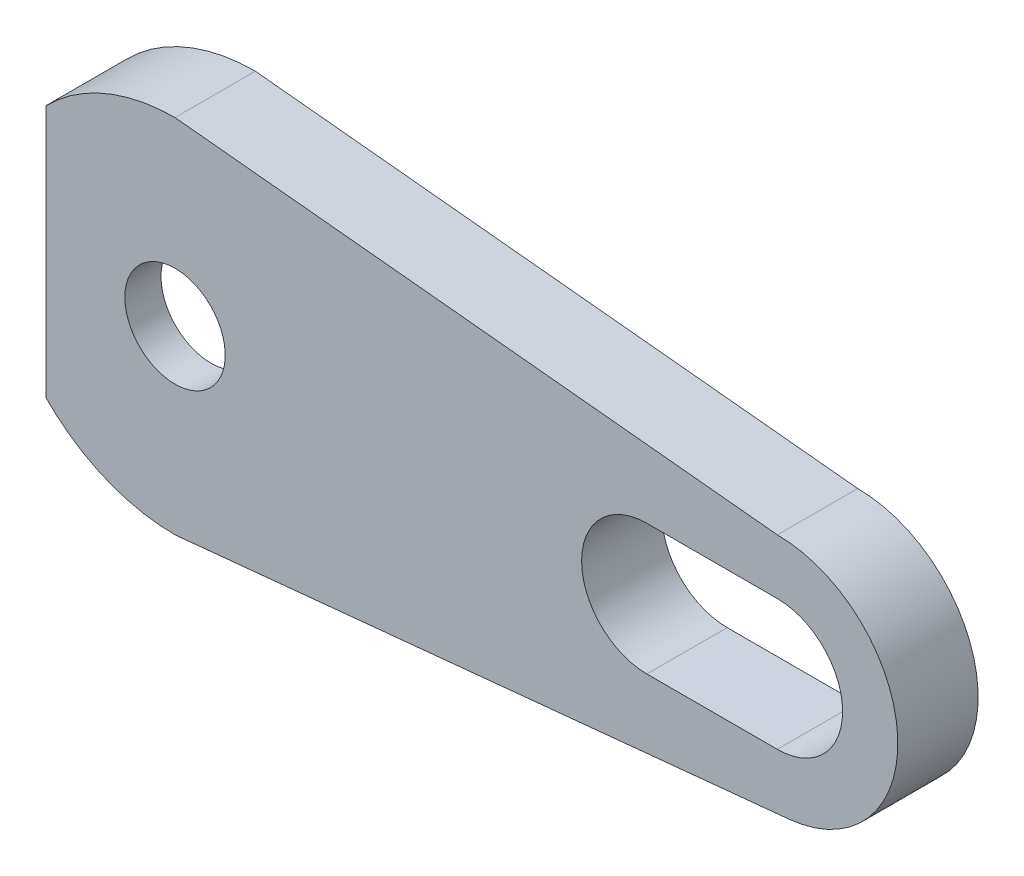
ISO-10303-21;
HEADER;
FILE_DESCRIPTION(('STEP AP214'),'2;1');
FILE_NAME('part.step','',(''),(''),'','','');
FILE_SCHEMA(('AUTOMOTIVE_DESIGN { 1 0 10303 214 1 1 1 1 }'));
ENDSEC;
DATA;
#1=APPLICATION_CONTEXT('core data for automotive mechanical design processes');
#2=APPLICATION_PROTOCOL_DEFINITION('international standard','automotive_design',2000,#1);
#3=PRODUCT_CONTEXT('',#1,'mechanical');
#4=PRODUCT('Part','Part','',(#3));
#5=PRODUCT_RELATED_PRODUCT_CATEGORY('part','',(#4));
#6=PRODUCT_DEFINITION_FORMATION('','',#4);
#7=PRODUCT_DEFINITION_CONTEXT('part definition',#1,'design');
#8=PRODUCT_DEFINITION('design','',#6,#7);
#9=PRODUCT_DEFINITION_SHAPE('','',#8);
#10=(LENGTH_UNIT() NAMED_UNIT(*) SI_UNIT(.MILLI.,.METRE.));
#11=(NAMED_UNIT(*) PLANE_ANGLE_UNIT() SI_UNIT($,.RADIAN.));
#12=(NAMED_UNIT(*) SI_UNIT($,.STERADIAN.) SOLID_ANGLE_UNIT());
#13=UNCERTAINTY_MEASURE_WITH_UNIT(LENGTH_MEASURE(1.E-05),#10,'distance_accuracy_value','');
#14=(GEOMETRIC_REPRESENTATION_CONTEXT(3) GLOBAL_UNCERTAINTY_ASSIGNED_CONTEXT((#13)) GLOBAL_UNIT_ASSIGNED_CONTEXT((#10,
#11,#12)) REPRESENTATION_CONTEXT('',''));
#15=CARTESIAN_POINT('',(0.,0.,0.));
#16=DIRECTION('',(0.,0.,1.));
#17=DIRECTION('',(1.,0.,0.));
#18=AXIS2_PLACEMENT_3D('',#15,#16,#17);
#19=CARTESIAN_POINT('',(0.,0.,4.));
#20=DIRECTION('',(0.,0.,-1.));
#21=DIRECTION('',(-1.,0.,0.));
#22=AXIS2_PLACEMENT_3D('',#19,#20,#21);
#23=PLANE('',#22);
#24=DIRECTION('',(1.,0.,0.));
#25=VECTOR('',#24,1.);
#26=CARTESIAN_POINT('',(23.5,-3.25,4.));
#27=LINE('',#26,#25);
#28=CARTESIAN_POINT('',(23.5,-3.25,4.));
#29=VERTEX_POINT('',#28);
#30=CARTESIAN_POINT('',(30.,-3.25,4.));
#31=VERTEX_POINT('',#30);
#32=EDGE_CURVE('E272',#29,#31,#27,.T.);
#33=ORIENTED_EDGE('',*,*,#32,.F.);
#34=CARTESIAN_POINT('',(23.5,0.,4.));
#35=DIRECTION('',(0.,0.,1.));
#36=DIRECTION('',(1.,0.,0.));
#37=AXIS2_PLACEMENT_3D('',#34,#35,#36);
#38=CIRCLE('',#37,3.25);
#39=CARTESIAN_POINT('',(23.5,3.25,4.));
#40=VERTEX_POINT('',#39);
#41=EDGE_CURVE('E260',#40,#29,#38,.T.);
#42=ORIENTED_EDGE('',*,*,#41,.F.);
#43=DIRECTION('',(-1.,0.,0.));
#44=VECTOR('',#43,1.);
#45=CARTESIAN_POINT('',(23.5,3.25,4.));
#46=LINE('',#45,#44);
#47=CARTESIAN_POINT('',(30.,3.25,4.));
#48=VERTEX_POINT('',#47);
#49=EDGE_CURVE('E256',#48,#40,#46,.T.);
#50=ORIENTED_EDGE('',*,*,#49,.F.);
#51=CARTESIAN_POINT('',(30.,0.,4.));
#52=DIRECTION('',(0.,0.,1.));
#53=DIRECTION('',(-1.,0.,0.));
#54=AXIS2_PLACEMENT_3D('',#51,#52,#53);
#55=CIRCLE('',#54,3.25);
#56=EDGE_CURVE('E270',#31,#48,#55,.T.);
#57=ORIENTED_EDGE('',*,*,#56,.F.);
#58=EDGE_LOOP('',(#33,#42,#50,#57));
#59=FACE_BOUND('',#58,.T.);
#60=DIRECTION('',(0.995133097794459,0.0985399293383375,0.));
#61=VECTOR('',#60,1.);
#62=CARTESIAN_POINT('',(0.,-9.,4.));
#63=LINE('',#62,#61);
#64=CARTESIAN_POINT('',(0.,-9.,4.));
#65=VERTEX_POINT('',#64);
#66=CARTESIAN_POINT('',(30.59123957603,-5.97079858676675,4.));
#67=VERTEX_POINT('',#66);
#68=EDGE_CURVE('E243',#65,#67,#63,.T.);
#69=ORIENTED_EDGE('',*,*,#68,.T.);
#70=CARTESIAN_POINT('',(30.,0.,4.));
#71=DIRECTION('',(0.,0.,1.));
#72=DIRECTION('',(-1.,0.,0.));
#73=AXIS2_PLACEMENT_3D('',#70,#71,#72);
#74=CIRCLE('',#73,6.);
#75=CARTESIAN_POINT('',(30.,6.,4.));
#76=VERTEX_POINT('',#75);
#77=EDGE_CURVE('E241',#67,#76,#74,.T.);
#78=ORIENTED_EDGE('',*,*,#77,.T.);
#79=DIRECTION('',(-0.995037190209989,0.0995037190209989,0.));
#80=VECTOR('',#79,1.);
#81=CARTESIAN_POINT('',(0.,9.,4.));
#82=LINE('',#81,#80);
#83=CARTESIAN_POINT('',(0.,9.,4.));
#84=VERTEX_POINT('',#83);
#85=EDGE_CURVE('E207',#76,#84,#82,.T.);
#86=ORIENTED_EDGE('',*,*,#85,.T.);
#87=CARTESIAN_POINT('',(0.,0.,4.));
#88=DIRECTION('',(0.,0.,1.));
#89=DIRECTION('',(-1.,0.,0.));
#90=AXIS2_PLACEMENT_3D('',#87,#88,#89);
#91=CIRCLE('',#90,9.);
#92=CARTESIAN_POINT('',(-6.42654307097902,6.30075742723457,4.));
#93=VERTEX_POINT('',#92);
#94=EDGE_CURVE('E211',#84,#93,#91,.T.);
#95=ORIENTED_EDGE('',*,*,#94,.T.);
#96=DIRECTION('',(0.,1.,0.));
#97=VECTOR('',#96,1.);
#98=CARTESIAN_POINT('',(-6.42654307097901,-6.30075742723457,4.));
#99=LINE('',#98,#97);
#100=CARTESIAN_POINT('',(-6.42654307097901,-6.30075742723457,4.));
#101=VERTEX_POINT('',#100);
#102=EDGE_CURVE('E160',#101,#93,#99,.T.);
#103=ORIENTED_EDGE('',*,*,#102,.F.);
#104=CARTESIAN_POINT('',(0.,0.,4.));
#105=DIRECTION('',(0.,0.,1.));
#106=DIRECTION('',(1.,0.,0.));
#107=AXIS2_PLACEMENT_3D('',#104,#105,#106);
#108=CIRCLE('',#107,9.);
#109=EDGE_CURVE('E245',#101,#65,#108,.T.);
#110=ORIENTED_EDGE('',*,*,#109,.T.);
#111=EDGE_LOOP('',(#69,#78,#86,#95,#103,#110));
#112=FACE_BOUND('',#111,.T.);
#113=CARTESIAN_POINT('',(0.,0.,4.));
#114=DIRECTION('',(0.,0.,-1.));
#115=DIRECTION('',(-1.,0.,0.));
#116=AXIS2_PLACEMENT_3D('',#113,#114,#115);
#117=CIRCLE('',#116,2.5);
#118=CARTESIAN_POINT('',(-2.5,0.,4.));
#119=VERTEX_POINT('',#118);
#120=EDGE_CURVE('E291',#119,#119,#117,.T.);
#121=ORIENTED_EDGE('',*,*,#120,.T.);
#122=EDGE_LOOP('',(#121));
#123=FACE_BOUND('',#122,.T.);
#124=ADVANCED_FACE('F35',(#59,#112,#123),#23,.F.);
#125=CARTESIAN_POINT('',(0.,0.,0.));
#126=DIRECTION('',(0.,0.,-1.));
#127=DIRECTION('',(-1.,0.,0.));
#128=AXIS2_PLACEMENT_3D('',#125,#126,#127);
#129=PLANE('',#128);
#130=CARTESIAN_POINT('',(0.,0.,0.));
#131=DIRECTION('',(0.,0.,1.));
#132=DIRECTION('',(-1.,0.,0.));
#133=AXIS2_PLACEMENT_3D('',#130,#131,#132);
#134=CIRCLE('',#133,9.);
#135=CARTESIAN_POINT('',(0.,9.,0.));
#136=VERTEX_POINT('',#135);
#137=CARTESIAN_POINT('',(-6.42654307097901,6.30075742723457,0.));
#138=VERTEX_POINT('',#137);
#139=EDGE_CURVE('E179',#136,#138,#134,.T.);
#140=ORIENTED_EDGE('',*,*,#139,.F.);
#141=DIRECTION('',(-0.995037190209989,0.0995037190209989,0.));
#142=VECTOR('',#141,1.);
#143=CARTESIAN_POINT('',(0.,9.,0.));
#144=LINE('',#143,#142);
#145=CARTESIAN_POINT('',(30.,6.,0.));
#146=VERTEX_POINT('',#145);
#147=EDGE_CURVE('E208',#146,#136,#144,.T.);
#148=ORIENTED_EDGE('',*,*,#147,.F.);
#149=CARTESIAN_POINT('',(30.,0.,0.));
#150=DIRECTION('',(0.,0.,1.));
#151=DIRECTION('',(-1.,0.,0.));
#152=AXIS2_PLACEMENT_3D('',#149,#150,#151);
#153=CIRCLE('',#152,6.);
#154=CARTESIAN_POINT('',(30.59123957603,-5.97079858676675,0.));
#155=VERTEX_POINT('',#154);
#156=EDGE_CURVE('E212',#155,#146,#153,.T.);
#157=ORIENTED_EDGE('',*,*,#156,.F.);
#158=DIRECTION('',(0.995133097794459,0.0985399293383375,0.));
#159=VECTOR('',#158,1.);
#160=CARTESIAN_POINT('',(0.,-9.,0.));
#161=LINE('',#160,#159);
#162=CARTESIAN_POINT('',(0.,-9.,0.));
#163=VERTEX_POINT('',#162);
#164=EDGE_CURVE('E214',#163,#155,#161,.T.);
#165=ORIENTED_EDGE('',*,*,#164,.F.);
#166=CARTESIAN_POINT('',(0.,0.,0.));
#167=DIRECTION('',(0.,0.,1.));
#168=DIRECTION('',(1.,0.,0.));
#169=AXIS2_PLACEMENT_3D('',#166,#167,#168);
#170=CIRCLE('',#169,9.);
#171=CARTESIAN_POINT('',(-6.42654307097901,-6.30075742723457,0.));
#172=VERTEX_POINT('',#171);
#173=EDGE_CURVE('E216',#172,#163,#170,.T.);
#174=ORIENTED_EDGE('',*,*,#173,.F.);
#175=DIRECTION('',(-0.707106781186548,-0.707106781186548,0.));
#176=VECTOR('',#175,1.);
#177=CARTESIAN_POINT('',(-4.37578564374445,-4.25,0.));
#178=LINE('',#177,#176);
#179=CARTESIAN_POINT('',(-4.37578564374444,-4.25,0.));
#180=VERTEX_POINT('',#179);
#181=EDGE_CURVE('E219',#180,#172,#178,.T.);
#182=ORIENTED_EDGE('',*,*,#181,.F.);
#183=CARTESIAN_POINT('',(0.,0.,0.));
#184=DIRECTION('',(0.,0.,-1.));
#185=DIRECTION('',(-1.,0.,0.));
#186=AXIS2_PLACEMENT_3D('',#183,#184,#185);
#187=CIRCLE('',#186,6.1);
#188=CARTESIAN_POINT('',(4.37578564374445,-4.25,0.));
#189=VERTEX_POINT('',#188);
#190=EDGE_CURVE('E222',#189,#180,#187,.T.);
#191=ORIENTED_EDGE('',*,*,#190,.F.);
#192=DIRECTION('',(-0.993627549913592,-0.112713317991759,0.));
#193=VECTOR('',#192,1.);
#194=CARTESIAN_POINT('',(17.3155972903769,-2.78215713975806,0.));
#195=LINE('',#194,#193);
#196=CARTESIAN_POINT('',(17.3155972903769,-2.78215713975806,0.));
#197=VERTEX_POINT('',#196);
#198=EDGE_CURVE('E225',#197,#189,#195,.T.);
#199=ORIENTED_EDGE('',*,*,#198,.F.);
#200=CARTESIAN_POINT('',(17.,0.,0.));
#201=DIRECTION('',(0.,0.,-1.));
#202=DIRECTION('',(1.,0.,0.));
#203=AXIS2_PLACEMENT_3D('',#200,#201,#202);
#204=CIRCLE('',#203,2.8);
#205=CARTESIAN_POINT('',(17.3155972903769,2.78215713975806,0.));
#206=VERTEX_POINT('',#205);
#207=EDGE_CURVE('E228',#206,#197,#204,.T.);
#208=ORIENTED_EDGE('',*,*,#207,.F.);
#209=DIRECTION('',(0.993627549913592,-0.112713317991759,0.));
#210=VECTOR('',#209,1.);
#211=CARTESIAN_POINT('',(4.37578564374445,4.25,0.));
#212=LINE('',#211,#210);
#213=CARTESIAN_POINT('',(4.37578564374445,4.25,0.));
#214=VERTEX_POINT('',#213);
#215=EDGE_CURVE('E231',#214,#206,#212,.T.);
#216=ORIENTED_EDGE('',*,*,#215,.F.);
#217=CARTESIAN_POINT('',(0.,0.,0.));
#218=DIRECTION('',(0.,0.,-1.));
#219=DIRECTION('',(1.,0.,0.));
#220=AXIS2_PLACEMENT_3D('',#217,#218,#219);
#221=CIRCLE('',#220,6.1);
#222=CARTESIAN_POINT('',(-4.37578564374445,4.25,0.));
#223=VERTEX_POINT('',#222);
#224=EDGE_CURVE('E234',#223,#214,#221,.T.);
#225=ORIENTED_EDGE('',*,*,#224,.F.);
#226=DIRECTION('',(0.707106781186548,-0.707106781186548,0.));
#227=VECTOR('',#226,1.);
#228=CARTESIAN_POINT('',(-4.37578564374445,4.25,0.));
#229=LINE('',#228,#227);
#230=EDGE_CURVE('E236',#138,#223,#229,.T.);
#231=ORIENTED_EDGE('',*,*,#230,.F.);
#232=EDGE_LOOP('',(#140,#148,#157,#165,#174,#182,#191,#199,#208,#216,#225,#231));
#233=FACE_BOUND('',#232,.T.);
#234=DIRECTION('',(-1.,0.,0.));
#235=VECTOR('',#234,1.);
#236=CARTESIAN_POINT('',(23.5,3.25,0.));
#237=LINE('',#236,#235);
#238=CARTESIAN_POINT('',(30.,3.25,0.));
#239=VERTEX_POINT('',#238);
#240=CARTESIAN_POINT('',(23.5,3.25,0.));
#241=VERTEX_POINT('',#240);
#242=EDGE_CURVE('E257',#239,#241,#237,.T.);
#243=ORIENTED_EDGE('',*,*,#242,.T.);
#244=CARTESIAN_POINT('',(23.5,0.,0.));
#245=DIRECTION('',(0.,0.,1.));
#246=DIRECTION('',(1.,0.,0.));
#247=AXIS2_PLACEMENT_3D('',#244,#245,#246);
#248=CIRCLE('',#247,3.25);
#249=CARTESIAN_POINT('',(23.5,-3.25,0.));
#250=VERTEX_POINT('',#249);
#251=EDGE_CURVE('E174',#241,#250,#248,.T.);
#252=ORIENTED_EDGE('',*,*,#251,.T.);
#253=DIRECTION('',(1.,0.,0.));
#254=VECTOR('',#253,1.);
#255=CARTESIAN_POINT('',(23.5,-3.25,0.));
#256=LINE('',#255,#254);
#257=CARTESIAN_POINT('',(30.,-3.25,0.));
#258=VERTEX_POINT('',#257);
#259=EDGE_CURVE('E264',#250,#258,#256,.T.);
#260=ORIENTED_EDGE('',*,*,#259,.T.);
#261=CARTESIAN_POINT('',(30.,0.,0.));
#262=DIRECTION('',(0.,0.,1.));
#263=DIRECTION('',(-1.,0.,0.));
#264=AXIS2_PLACEMENT_3D('',#261,#262,#263);
#265=CIRCLE('',#264,3.25);
#266=EDGE_CURVE('E261',#258,#239,#265,.T.);
#267=ORIENTED_EDGE('',*,*,#266,.T.);
#268=EDGE_LOOP('',(#243,#252,#260,#267));
#269=FACE_BOUND('',#268,.T.);
#270=ADVANCED_FACE('F311',(#233,#269),#129,.T.);
#271=CARTESIAN_POINT('',(0.,0.,4.));
#272=DIRECTION('',(0.,0.,-1.));
#273=DIRECTION('',(-1.,0.,0.));
#274=AXIS2_PLACEMENT_3D('',#271,#272,#273);
#275=CYLINDRICAL_SURFACE('',#274,9.);
#276=DIRECTION('',(0.,0.,-1.));
#277=VECTOR('',#276,1.);
#278=CARTESIAN_POINT('',(-6.42654307097901,6.30075742723457,4.));
#279=LINE('',#278,#277);
#280=CARTESIAN_POINT('',(-6.42654307097902,6.30075742723457,2.2));
#281=VERTEX_POINT('',#280);
#282=EDGE_CURVE('E43',#281,#138,#279,.T.);
#283=ORIENTED_EDGE('',*,*,#282,.F.);
#284=EDGE_CURVE('E11',#93,#281,#279,.T.);
#285=ORIENTED_EDGE('',*,*,#284,.F.);
#286=ORIENTED_EDGE('',*,*,#94,.F.);
#287=DIRECTION('',(0.,0.,-1.));
#288=VECTOR('',#287,1.);
#289=CARTESIAN_POINT('',(0.,9.,4.));
#290=LINE('',#289,#288);
#291=EDGE_CURVE('E205',#84,#136,#290,.T.);
#292=ORIENTED_EDGE('',*,*,#291,.T.);
#293=ORIENTED_EDGE('',*,*,#139,.T.);
#294=EDGE_LOOP('',(#283,#285,#286,#292,#293));
#295=FACE_BOUND('',#294,.T.);
#296=ADVANCED_FACE('F37',(#295),#275,.T.);
#297=CARTESIAN_POINT('',(-4.37578564374445,4.25,4.));
#298=DIRECTION('',(0.707106781186547,0.707106781186547,0.));
#299=DIRECTION('',(-0.707106781186548,0.707106781186548,0.));
#300=AXIS2_PLACEMENT_3D('',#297,#298,#299);
#301=PLANE('',#300);
#302=DIRECTION('',(0.,0.,-1.));
#303=VECTOR('',#302,1.);
#304=CARTESIAN_POINT('',(-4.37578564374445,4.25,4.));
#305=LINE('',#304,#303);
#306=CARTESIAN_POINT('',(-4.37578564374445,4.25,2.2));
#307=VERTEX_POINT('',#306);
#308=EDGE_CURVE('E173',#307,#223,#305,.T.);
#309=ORIENTED_EDGE('',*,*,#308,.F.);
#310=DIRECTION('',(-0.707106781186548,0.707106781186548,0.));
#311=VECTOR('',#310,1.);
#312=CARTESIAN_POINT('',(-4.37578564374445,4.25,2.2));
#313=LINE('',#312,#311);
#314=EDGE_CURVE('E155',#307,#281,#313,.T.);
#315=ORIENTED_EDGE('',*,*,#314,.T.);
#316=ORIENTED_EDGE('',*,*,#282,.T.);
#317=ORIENTED_EDGE('',*,*,#230,.T.);
#318=EDGE_LOOP('',(#309,#315,#316,#317));
#319=FACE_BOUND('',#318,.T.);
#320=ADVANCED_FACE('F170',(#319),#301,.F.);
#321=CARTESIAN_POINT('',(0.,0.,4.));
#322=DIRECTION('',(0.,0.,-1.));
#323=DIRECTION('',(-1.,0.,0.));
#324=AXIS2_PLACEMENT_3D('',#321,#322,#323);
#325=CYLINDRICAL_SURFACE('',#324,6.1);
#326=DIRECTION('',(0.,0.,-1.));
#327=VECTOR('',#326,1.);
#328=CARTESIAN_POINT('',(4.37578564374445,4.25,4.));
#329=LINE('',#328,#327);
#330=CARTESIAN_POINT('',(4.37578564374445,4.25,2.2));
#331=VERTEX_POINT('',#330);
#332=EDGE_CURVE('E180',#331,#214,#329,.T.);
#333=ORIENTED_EDGE('',*,*,#332,.F.);
#334=CARTESIAN_POINT('',(0.,0.,2.2));
#335=DIRECTION('',(0.,0.,-1.));
#336=DIRECTION('',(-1.,0.,0.));
#337=AXIS2_PLACEMENT_3D('',#334,#335,#336);
#338=CIRCLE('',#337,6.1);
#339=EDGE_CURVE('E175',#331,#307,#338,.F.);
#340=ORIENTED_EDGE('',*,*,#339,.T.);
#341=ORIENTED_EDGE('',*,*,#308,.T.);
#342=ORIENTED_EDGE('',*,*,#224,.T.);
#343=EDGE_LOOP('',(#333,#340,#341,#342));
#344=FACE_BOUND('',#343,.T.);
#345=ADVANCED_FACE('F360',(#344),#325,.F.);
#346=CARTESIAN_POINT('',(4.37578564374445,4.25,4.));
#347=DIRECTION('',(0.112713317991759,0.993627549913592,0.));
#348=DIRECTION('',(-0.993627549913592,0.112713317991759,0.));
#349=AXIS2_PLACEMENT_3D('',#346,#347,#348);
#350=PLANE('',#349);
#351=DIRECTION('',(0.,0.,-1.));
#352=VECTOR('',#351,1.);
#353=CARTESIAN_POINT('',(17.3155972903769,2.78215713975806,4.));
#354=LINE('',#353,#352);
#355=CARTESIAN_POINT('',(17.3155972903769,2.78215713975806,2.2));
#356=VERTEX_POINT('',#355);
#357=EDGE_CURVE('E183',#356,#206,#354,.T.);
#358=ORIENTED_EDGE('',*,*,#357,.F.);
#359=DIRECTION('',(-0.993627549913592,0.112713317991759,0.));
#360=VECTOR('',#359,1.);
#361=CARTESIAN_POINT('',(4.37578564374445,4.25,2.2));
#362=LINE('',#361,#360);
#363=EDGE_CURVE('E276',#356,#331,#362,.T.);
#364=ORIENTED_EDGE('',*,*,#363,.T.);
#365=ORIENTED_EDGE('',*,*,#332,.T.);
#366=ORIENTED_EDGE('',*,*,#215,.T.);
#367=EDGE_LOOP('',(#358,#364,#365,#366));
#368=FACE_BOUND('',#367,.T.);
#369=ADVANCED_FACE('F356',(#368),#350,.F.);
#370=CARTESIAN_POINT('',(17.,0.,4.));
#371=DIRECTION('',(0.,0.,-1.));
#372=DIRECTION('',(-1.,0.,0.));
#373=AXIS2_PLACEMENT_3D('',#370,#371,#372);
#374=CYLINDRICAL_SURFACE('',#373,2.8);
#375=DIRECTION('',(0.,0.,-1.));
#376=VECTOR('',#375,1.);
#377=CARTESIAN_POINT('',(17.3155972903769,-2.78215713975806,4.));
#378=LINE('',#377,#376);
#379=CARTESIAN_POINT('',(17.3155972903769,-2.78215713975806,2.2));
#380=VERTEX_POINT('',#379);
#381=EDGE_CURVE('E187',#380,#197,#378,.T.);
#382=ORIENTED_EDGE('',*,*,#381,.F.);
#383=CARTESIAN_POINT('',(17.,0.,2.2));
#384=DIRECTION('',(0.,0.,-1.));
#385=DIRECTION('',(-1.,0.,0.));
#386=AXIS2_PLACEMENT_3D('',#383,#384,#385);
#387=CIRCLE('',#386,2.8);
#388=EDGE_CURVE('E279',#380,#356,#387,.F.);
#389=ORIENTED_EDGE('',*,*,#388,.T.);
#390=ORIENTED_EDGE('',*,*,#357,.T.);
#391=ORIENTED_EDGE('',*,*,#207,.T.);
#392=EDGE_LOOP('',(#382,#389,#390,#391));
#393=FACE_BOUND('',#392,.T.);
#394=ADVANCED_FACE('F352',(#393),#374,.F.);
#395=CARTESIAN_POINT('',(17.3155972903769,-2.78215713975806,4.));
#396=DIRECTION('',(0.112713317991759,-0.993627549913592,0.));
#397=DIRECTION('',(0.993627549913592,0.112713317991759,0.));
#398=AXIS2_PLACEMENT_3D('',#395,#396,#397);
#399=PLANE('',#398);
#400=DIRECTION('',(0.,0.,-1.));
#401=VECTOR('',#400,1.);
#402=CARTESIAN_POINT('',(4.37578564374445,-4.25,4.));
#403=LINE('',#402,#401);
#404=CARTESIAN_POINT('',(4.37578564374445,-4.25,2.2));
#405=VERTEX_POINT('',#404);
#406=EDGE_CURVE('E189',#405,#189,#403,.T.);
#407=ORIENTED_EDGE('',*,*,#406,.F.);
#408=DIRECTION('',(0.993627549913592,0.112713317991759,0.));
#409=VECTOR('',#408,1.);
#410=CARTESIAN_POINT('',(17.3155972903769,-2.78215713975806,2.2));
#411=LINE('',#410,#409);
#412=EDGE_CURVE('E282',#405,#380,#411,.T.);
#413=ORIENTED_EDGE('',*,*,#412,.T.);
#414=ORIENTED_EDGE('',*,*,#381,.T.);
#415=ORIENTED_EDGE('',*,*,#198,.T.);
#416=EDGE_LOOP('',(#407,#413,#414,#415));
#417=FACE_BOUND('',#416,.T.);
#418=ADVANCED_FACE('F348',(#417),#399,.F.);
#419=CARTESIAN_POINT('',(0.,0.,4.));
#420=DIRECTION('',(0.,0.,-1.));
#421=DIRECTION('',(-1.,0.,0.));
#422=AXIS2_PLACEMENT_3D('',#419,#420,#421);
#423=CYLINDRICAL_SURFACE('',#422,6.1);
#424=DIRECTION('',(0.,0.,-1.));
#425=VECTOR('',#424,1.);
#426=CARTESIAN_POINT('',(-4.37578564374444,-4.25,4.));
#427=LINE('',#426,#425);
#428=CARTESIAN_POINT('',(-4.37578564374445,-4.25,2.2));
#429=VERTEX_POINT('',#428);
#430=EDGE_CURVE('E191',#429,#180,#427,.T.);
#431=ORIENTED_EDGE('',*,*,#430,.F.);
#432=CARTESIAN_POINT('',(0.,0.,2.2));
#433=DIRECTION('',(0.,0.,-1.));
#434=DIRECTION('',(-1.,0.,0.));
#435=AXIS2_PLACEMENT_3D('',#432,#433,#434);
#436=CIRCLE('',#435,6.1);
#437=EDGE_CURVE('E285',#429,#405,#436,.F.);
#438=ORIENTED_EDGE('',*,*,#437,.T.);
#439=ORIENTED_EDGE('',*,*,#406,.T.);
#440=ORIENTED_EDGE('',*,*,#190,.T.);
#441=EDGE_LOOP('',(#431,#438,#439,#440));
#442=FACE_BOUND('',#441,.T.);
#443=ADVANCED_FACE('F344',(#442),#423,.F.);
#444=CARTESIAN_POINT('',(-4.37578564374445,-4.25,4.));
#445=DIRECTION('',(0.707106781186547,-0.707106781186547,0.));
#446=DIRECTION('',(0.707106781186548,0.707106781186548,0.));
#447=AXIS2_PLACEMENT_3D('',#444,#445,#446);
#448=PLANE('',#447);
#449=DIRECTION('',(0.,0.,-1.));
#450=VECTOR('',#449,1.);
#451=CARTESIAN_POINT('',(-6.42654307097901,-6.30075742723457,4.));
#452=LINE('',#451,#450);
#453=CARTESIAN_POINT('',(-6.42654307097901,-6.30075742723457,2.2));
#454=VERTEX_POINT('',#453);
#455=EDGE_CURVE('E196',#454,#172,#452,.T.);
#456=ORIENTED_EDGE('',*,*,#455,.F.);
#457=DIRECTION('',(0.707106781186548,0.707106781186548,0.));
#458=VECTOR('',#457,1.);
#459=CARTESIAN_POINT('',(-4.37578564374445,-4.25,2.2));
#460=LINE('',#459,#458);
#461=EDGE_CURVE('E158',#454,#429,#460,.T.);
#462=ORIENTED_EDGE('',*,*,#461,.T.);
#463=ORIENTED_EDGE('',*,*,#430,.T.);
#464=ORIENTED_EDGE('',*,*,#181,.T.);
#465=EDGE_LOOP('',(#456,#462,#463,#464));
#466=FACE_BOUND('',#465,.T.);
#467=ADVANCED_FACE('F340',(#466),#448,.F.);
#468=CARTESIAN_POINT('',(0.,0.,4.));
#469=DIRECTION('',(0.,0.,-1.));
#470=DIRECTION('',(-1.,0.,0.));
#471=AXIS2_PLACEMENT_3D('',#468,#469,#470);
#472=CYLINDRICAL_SURFACE('',#471,9.);
#473=ORIENTED_EDGE('',*,*,#173,.T.);
#474=DIRECTION('',(0.,0.,-1.));
#475=VECTOR('',#474,1.);
#476=CARTESIAN_POINT('',(0.,-9.,4.));
#477=LINE('',#476,#475);
#478=EDGE_CURVE('E197',#65,#163,#477,.T.);
#479=ORIENTED_EDGE('',*,*,#478,.F.);
#480=ORIENTED_EDGE('',*,*,#109,.F.);
#481=EDGE_CURVE('E193',#101,#454,#452,.T.);
#482=ORIENTED_EDGE('',*,*,#481,.T.);
#483=ORIENTED_EDGE('',*,*,#455,.T.);
#484=EDGE_LOOP('',(#473,#479,#480,#482,#483));
#485=FACE_BOUND('',#484,.T.);
#486=ADVANCED_FACE('F336',(#485),#472,.T.);
#487=CARTESIAN_POINT('',(0.,-9.,4.));
#488=DIRECTION('',(-0.0985399293383375,0.995133097794459,0.));
#489=DIRECTION('',(-0.995133097794459,-0.0985399293383375,0.));
#490=AXIS2_PLACEMENT_3D('',#487,#488,#489);
#491=PLANE('',#490);
#492=ORIENTED_EDGE('',*,*,#478,.T.);
#493=ORIENTED_EDGE('',*,*,#164,.T.);
#494=DIRECTION('',(0.,0.,-1.));
#495=VECTOR('',#494,1.);
#496=CARTESIAN_POINT('',(30.59123957603,-5.97079858676675,4.));
#497=LINE('',#496,#495);
#498=EDGE_CURVE('E199',#67,#155,#497,.T.);
#499=ORIENTED_EDGE('',*,*,#498,.F.);
#500=ORIENTED_EDGE('',*,*,#68,.F.);
#501=EDGE_LOOP('',(#492,#493,#499,#500));
#502=FACE_BOUND('',#501,.T.);
#503=ADVANCED_FACE('F332',(#502),#491,.F.);
#504=CARTESIAN_POINT('',(30.,0.,4.));
#505=DIRECTION('',(0.,0.,-1.));
#506=DIRECTION('',(-1.,0.,0.));
#507=AXIS2_PLACEMENT_3D('',#504,#505,#506);
#508=CYLINDRICAL_SURFACE('',#507,6.);
#509=ORIENTED_EDGE('',*,*,#156,.T.);
#510=DIRECTION('',(0.,0.,-1.));
#511=VECTOR('',#510,1.);
#512=CARTESIAN_POINT('',(30.,6.,4.));
#513=LINE('',#512,#511);
#514=EDGE_CURVE('E202',#76,#146,#513,.T.);
#515=ORIENTED_EDGE('',*,*,#514,.F.);
#516=ORIENTED_EDGE('',*,*,#77,.F.);
#517=ORIENTED_EDGE('',*,*,#498,.T.);
#518=EDGE_LOOP('',(#509,#515,#516,#517));
#519=FACE_BOUND('',#518,.T.);
#520=ADVANCED_FACE('F328',(#519),#508,.T.);
#521=CARTESIAN_POINT('',(0.,9.,4.));
#522=DIRECTION('',(-0.0995037190209989,-0.995037190209989,0.));
#523=DIRECTION('',(0.995037190209989,-0.0995037190209989,0.));
#524=AXIS2_PLACEMENT_3D('',#521,#522,#523);
#525=PLANE('',#524);
#526=ORIENTED_EDGE('',*,*,#147,.T.);
#527=ORIENTED_EDGE('',*,*,#291,.F.);
#528=ORIENTED_EDGE('',*,*,#85,.F.);
#529=ORIENTED_EDGE('',*,*,#514,.T.);
#530=EDGE_LOOP('',(#526,#527,#528,#529));
#531=FACE_BOUND('',#530,.T.);
#532=ADVANCED_FACE('F325',(#531),#525,.F.);
#533=CARTESIAN_POINT('',(23.5,0.,4.));
#534=DIRECTION('',(0.,0.,-1.));
#535=DIRECTION('',(-1.,0.,0.));
#536=AXIS2_PLACEMENT_3D('',#533,#534,#535);
#537=CYLINDRICAL_SURFACE('',#536,3.25);
#538=ORIENTED_EDGE('',*,*,#41,.T.);
#539=DIRECTION('',(0.,0.,-1.));
#540=VECTOR('',#539,1.);
#541=CARTESIAN_POINT('',(23.5,-3.25,4.));
#542=LINE('',#541,#540);
#543=EDGE_CURVE('E239',#29,#250,#542,.T.);
#544=ORIENTED_EDGE('',*,*,#543,.T.);
#545=ORIENTED_EDGE('',*,*,#251,.F.);
#546=DIRECTION('',(0.,0.,-1.));
#547=VECTOR('',#546,1.);
#548=CARTESIAN_POINT('',(23.5,3.25,4.));
#549=LINE('',#548,#547);
#550=EDGE_CURVE('E253',#40,#241,#549,.T.);
#551=ORIENTED_EDGE('',*,*,#550,.F.);
#552=EDGE_LOOP('',(#538,#544,#545,#551));
#553=FACE_BOUND('',#552,.T.);
#554=ADVANCED_FACE('F322',(#553),#537,.F.);
#555=CARTESIAN_POINT('',(23.5,-3.25,4.));
#556=DIRECTION('',(0.,1.,0.));
#557=DIRECTION('',(-1.,0.,0.));
#558=AXIS2_PLACEMENT_3D('',#555,#556,#557);
#559=PLANE('',#558);
#560=ORIENTED_EDGE('',*,*,#259,.F.);
#561=ORIENTED_EDGE('',*,*,#543,.F.);
#562=ORIENTED_EDGE('',*,*,#32,.T.);
#563=DIRECTION('',(0.,0.,-1.));
#564=VECTOR('',#563,1.);
#565=CARTESIAN_POINT('',(30.,-3.25,4.));
#566=LINE('',#565,#564);
#567=EDGE_CURVE('E250',#31,#258,#566,.T.);
#568=ORIENTED_EDGE('',*,*,#567,.T.);
#569=EDGE_LOOP('',(#560,#561,#562,#568));
#570=FACE_BOUND('',#569,.T.);
#571=ADVANCED_FACE('F387',(#570),#559,.T.);
#572=CARTESIAN_POINT('',(30.,0.,4.));
#573=DIRECTION('',(0.,0.,-1.));
#574=DIRECTION('',(-1.,0.,0.));
#575=AXIS2_PLACEMENT_3D('',#572,#573,#574);
#576=CYLINDRICAL_SURFACE('',#575,3.25);
#577=ORIENTED_EDGE('',*,*,#266,.F.);
#578=ORIENTED_EDGE('',*,*,#567,.F.);
#579=ORIENTED_EDGE('',*,*,#56,.T.);
#580=DIRECTION('',(0.,0.,-1.));
#581=VECTOR('',#580,1.);
#582=CARTESIAN_POINT('',(30.,3.25,4.));
#583=LINE('',#582,#581);
#584=EDGE_CURVE('E57',#48,#239,#583,.T.);
#585=ORIENTED_EDGE('',*,*,#584,.T.);
#586=EDGE_LOOP('',(#577,#578,#579,#585));
#587=FACE_BOUND('',#586,.T.);
#588=ADVANCED_FACE('F307',(#587),#576,.F.);
#589=CARTESIAN_POINT('',(23.5,3.25,4.));
#590=DIRECTION('',(0.,-1.,0.));
#591=DIRECTION('',(1.,0.,0.));
#592=AXIS2_PLACEMENT_3D('',#589,#590,#591);
#593=PLANE('',#592);
#594=ORIENTED_EDGE('',*,*,#242,.F.);
#595=ORIENTED_EDGE('',*,*,#584,.F.);
#596=ORIENTED_EDGE('',*,*,#49,.T.);
#597=ORIENTED_EDGE('',*,*,#550,.T.);
#598=EDGE_LOOP('',(#594,#595,#596,#597));
#599=FACE_BOUND('',#598,.T.);
#600=ADVANCED_FACE('F300',(#599),#593,.T.);
#601=CARTESIAN_POINT('',(0.,0.,2.2));
#602=DIRECTION('',(0.,0.,-1.));
#603=DIRECTION('',(-1.,0.,0.));
#604=AXIS2_PLACEMENT_3D('',#601,#602,#603);
#605=PLANE('',#604);
#606=ORIENTED_EDGE('',*,*,#314,.F.);
#607=ORIENTED_EDGE('',*,*,#339,.F.);
#608=ORIENTED_EDGE('',*,*,#363,.F.);
#609=ORIENTED_EDGE('',*,*,#388,.F.);
#610=ORIENTED_EDGE('',*,*,#412,.F.);
#611=ORIENTED_EDGE('',*,*,#437,.F.);
#612=ORIENTED_EDGE('',*,*,#461,.F.);
#613=DIRECTION('',(0.,1.,0.));
#614=VECTOR('',#613,1.);
#615=CARTESIAN_POINT('',(-6.42654307097901,-6.30075742723457,2.2));
#616=LINE('',#615,#614);
#617=EDGE_CURVE('E49',#454,#281,#616,.T.);
#618=ORIENTED_EDGE('',*,*,#617,.T.);
#619=EDGE_LOOP('',(#606,#607,#608,#609,#610,#611,#612,#618));
#620=FACE_BOUND('',#619,.T.);
#621=CARTESIAN_POINT('',(0.,0.,2.2));
#622=DIRECTION('',(0.,0.,-1.));
#623=DIRECTION('',(-1.,0.,0.));
#624=AXIS2_PLACEMENT_3D('',#621,#622,#623);
#625=CIRCLE('',#624,2.5);
#626=CARTESIAN_POINT('',(-2.5,0.,2.2));
#627=VERTEX_POINT('',#626);
#628=EDGE_CURVE('E289',#627,#627,#625,.T.);
#629=ORIENTED_EDGE('',*,*,#628,.F.);
#630=EDGE_LOOP('',(#629));
#631=FACE_BOUND('',#630,.T.);
#632=ADVANCED_FACE('F152',(#620,#631),#605,.T.);
#633=CARTESIAN_POINT('',(-6.42654307097901,-6.30075742723457,2.2));
#634=DIRECTION('',(1.,0.,0.));
#635=DIRECTION('',(0.,0.,-1.));
#636=AXIS2_PLACEMENT_3D('',#633,#634,#635);
#637=PLANE('',#636);
#638=ORIENTED_EDGE('',*,*,#102,.T.);
#639=ORIENTED_EDGE('',*,*,#284,.T.);
#640=ORIENTED_EDGE('',*,*,#617,.F.);
#641=ORIENTED_EDGE('',*,*,#481,.F.);
#642=EDGE_LOOP('',(#638,#639,#640,#641));
#643=FACE_BOUND('',#642,.T.);
#644=ADVANCED_FACE('F163',(#643),#637,.F.);
#645=CARTESIAN_POINT('',(0.,0.,2.2));
#646=DIRECTION('',(0.,0.,1.));
#647=DIRECTION('',(1.,0.,0.));
#648=AXIS2_PLACEMENT_3D('',#645,#646,#647);
#649=CYLINDRICAL_SURFACE('',#648,2.5);
#650=ORIENTED_EDGE('',*,*,#628,.T.);
#651=EDGE_LOOP('',(#650));
#652=FACE_BOUND('',#651,.T.);
#653=ORIENTED_EDGE('',*,*,#120,.F.);
#654=EDGE_LOOP('',(#653));
#655=FACE_BOUND('',#654,.T.);
#656=ADVANCED_FACE('F297',(#652,#655),#649,.F.);
#657=CLOSED_SHELL('',(#124,#270,#296,#320,#345,#369,#394,#418,#443,#467,#486,#503,#520,#532,
#554,#571,#588,#600,#632,#644,#656));
#658=MANIFOLD_SOLID_BREP('B2',#657);
#659=ADVANCED_BREP_SHAPE_REPRESENTATION('',(#18,#658),#14);
#660=SHAPE_DEFINITION_REPRESENTATION(#9,#659);
ENDSEC;
END-ISO-10303-21;
